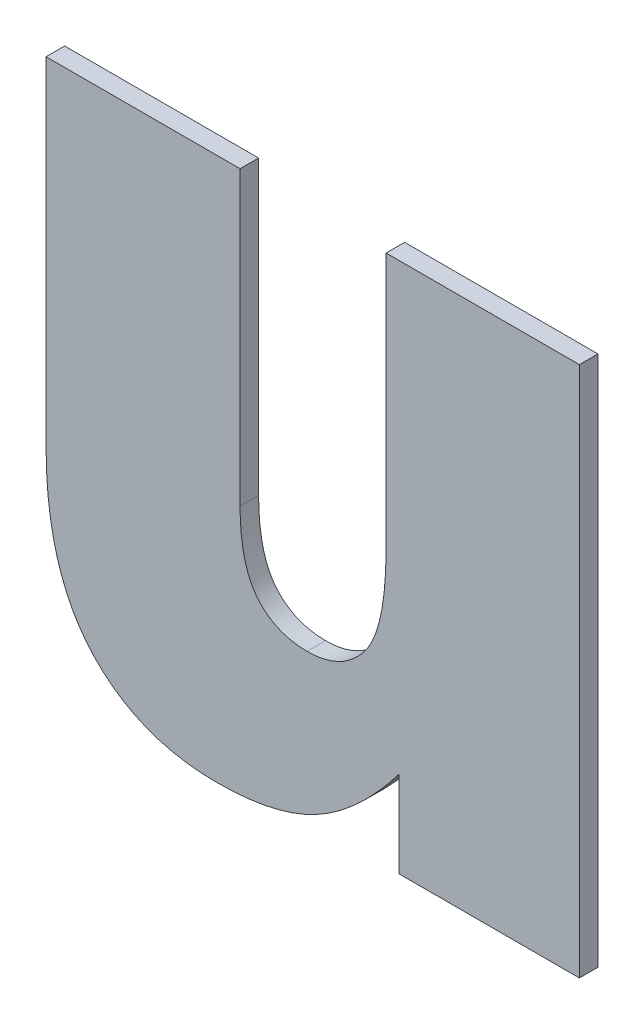
ISO-10303-21;
HEADER;
FILE_DESCRIPTION(('STEP AP214'),'2;1');
FILE_NAME('part.step','',(''),(''),'','','');
FILE_SCHEMA(('AUTOMOTIVE_DESIGN { 1 0 10303 214 1 1 1 1 }'));
ENDSEC;
DATA;
#1=APPLICATION_CONTEXT('core data for automotive mechanical design processes');
#2=APPLICATION_PROTOCOL_DEFINITION('international standard','automotive_design',2000,#1);
#3=PRODUCT_CONTEXT('',#1,'mechanical');
#4=PRODUCT('Part','Part','',(#3));
#5=PRODUCT_RELATED_PRODUCT_CATEGORY('part','',(#4));
#6=PRODUCT_DEFINITION_FORMATION('','',#4);
#7=PRODUCT_DEFINITION_CONTEXT('part definition',#1,'design');
#8=PRODUCT_DEFINITION('design','',#6,#7);
#9=PRODUCT_DEFINITION_SHAPE('','',#8);
#10=(LENGTH_UNIT() NAMED_UNIT(*) SI_UNIT(.MILLI.,.METRE.));
#11=(NAMED_UNIT(*) PLANE_ANGLE_UNIT() SI_UNIT($,.RADIAN.));
#12=(NAMED_UNIT(*) SI_UNIT($,.STERADIAN.) SOLID_ANGLE_UNIT());
#13=UNCERTAINTY_MEASURE_WITH_UNIT(LENGTH_MEASURE(1.E-05),#10,'distance_accuracy_value','');
#14=(GEOMETRIC_REPRESENTATION_CONTEXT(3) GLOBAL_UNCERTAINTY_ASSIGNED_CONTEXT((#13)) GLOBAL_UNIT_ASSIGNED_CONTEXT((#10,
#11,#12)) REPRESENTATION_CONTEXT('',''));
#15=CARTESIAN_POINT('',(0.,0.,0.));
#16=DIRECTION('',(0.,0.,1.));
#17=DIRECTION('',(1.,0.,0.));
#18=AXIS2_PLACEMENT_3D('',#15,#16,#17);
#19=CARTESIAN_POINT('',(1.1338047431866,-0.683885085588771,0.));
#20=DIRECTION('',(1.,0.,0.));
#21=DIRECTION('',(0.,1.,0.));
#22=AXIS2_PLACEMENT_3D('',#19,#20,#21);
#23=PLANE('',#22);
#24=DIRECTION('',(0.,1.,0.));
#25=VECTOR('',#24,1.);
#26=CARTESIAN_POINT('',(1.1338047431866,-0.683885085588771,0.));
#27=LINE('',#26,#25);
#28=CARTESIAN_POINT('',(1.1338047431866,-0.683885085588771,0.));
#29=VERTEX_POINT('',#28);
#30=CARTESIAN_POINT('',(1.1338047431866,-0.636643661734989,0.));
#31=VERTEX_POINT('',#30);
#32=EDGE_CURVE('E11',#29,#31,#27,.T.);
#33=ORIENTED_EDGE('',*,*,#32,.T.);
#34=DIRECTION('',(0.,0.,1.));
#35=VECTOR('',#34,1.);
#36=CARTESIAN_POINT('',(1.1338047431866,-0.636643661734989,0.));
#37=LINE('',#36,#35);
#38=CARTESIAN_POINT('',(1.1338047431866,-0.636643661734989,0.003));
#39=VERTEX_POINT('',#38);
#40=EDGE_CURVE('E24',#31,#39,#37,.T.);
#41=ORIENTED_EDGE('',*,*,#40,.T.);
#42=DIRECTION('',(0.,1.,0.));
#43=VECTOR('',#42,1.);
#44=CARTESIAN_POINT('',(1.1338047431866,-0.683885085588771,0.003));
#45=LINE('',#44,#43);
#46=CARTESIAN_POINT('',(1.1338047431866,-0.683885085588771,0.003));
#47=VERTEX_POINT('',#46);
#48=EDGE_CURVE('E124',#47,#39,#45,.T.);
#49=ORIENTED_EDGE('',*,*,#48,.F.);
#50=DIRECTION('',(0.,0.,1.));
#51=VECTOR('',#50,1.);
#52=CARTESIAN_POINT('',(1.1338047431866,-0.683885085588771,0.));
#53=LINE('',#52,#51);
#54=EDGE_CURVE('E243',#29,#47,#53,.T.);
#55=ORIENTED_EDGE('',*,*,#54,.F.);
#56=EDGE_LOOP('',(#33,#41,#49,#55));
#57=FACE_BOUND('',#56,.T.);
#58=ADVANCED_FACE('F17',(#57),#23,.T.);
#59=CARTESIAN_POINT('',(1.1446451665347,-0.698833458837191,0.));
#60=CARTESIAN_POINT('',(1.1446451665347,-0.698833458837191,0.003));
#61=CARTESIAN_POINT('',(1.1395102291592,-0.69883346021446,0.));
#62=CARTESIAN_POINT('',(1.1395102291592,-0.69883346021446,0.003));
#63=CARTESIAN_POINT('',(1.1338047413503,-0.691986878577577,0.));
#64=CARTESIAN_POINT('',(1.1338047413503,-0.691986878577577,0.003));
#65=CARTESIAN_POINT('',(1.1338047431866,-0.683885085588771,0.));
#66=CARTESIAN_POINT('',(1.1338047431866,-0.683885085588771,0.003));
#67=B_SPLINE_SURFACE_WITH_KNOTS('',2,1,((#59,#60),(#61,#62),(#63,#64),(#65,#66)),.UNSPECIFIED.,
.F.,.F.,.F.,(3,1,3),(2,2),(-2.,-1.,0.),(0.,0.0003),.UNSPECIFIED.);
#68=CARTESIAN_POINT('',(1.1446451665347,-0.698833458837191,0.));
#69=CARTESIAN_POINT('',(1.1395102291592,-0.69883346021446,0.));
#70=CARTESIAN_POINT('',(1.1338047413503,-0.691986878577577,0.));
#71=CARTESIAN_POINT('',(1.1338047431866,-0.683885085588771,0.));
#72=B_SPLINE_CURVE_WITH_KNOTS('',2,(#68,#69,#70,#71),.UNSPECIFIED.,.F.,.F.,(3,1,3),(-2.,-1.,0.),.UNSPECIFIED.);
#73=CARTESIAN_POINT('',(1.1446451665347,-0.698833458837191,0.));
#74=VERTEX_POINT('',#73);
#75=EDGE_CURVE('E235',#74,#29,#72,.T.);
#76=CARTESIAN_POINT('',(1.1446451665347,-0.698833458837191,0.003));
#77=CARTESIAN_POINT('',(1.1395102291592,-0.69883346021446,0.003));
#78=CARTESIAN_POINT('',(1.1338047413503,-0.691986878577577,0.003));
#79=CARTESIAN_POINT('',(1.1338047431866,-0.683885085588771,0.003));
#80=B_SPLINE_CURVE_WITH_KNOTS('',2,(#76,#77,#78,#79),.UNSPECIFIED.,.F.,.F.,(3,1,3),(-2.,-1.,0.),.UNSPECIFIED.);
#81=CARTESIAN_POINT('',(1.1446451665347,-0.698833458837191,0.003));
#82=VERTEX_POINT('',#81);
#83=EDGE_CURVE('E231',#82,#47,#80,.T.);
#84=DIRECTION('',(0.,0.,1.));
#85=VECTOR('',#84,1.);
#86=CARTESIAN_POINT('',(1.1446451665347,-0.698833458837191,0.));
#87=LINE('',#86,#85);
#88=EDGE_CURVE('E225',#74,#82,#87,.T.);
#89=ORIENTED_EDGE('',*,*,#75,.T.);
#90=ORIENTED_EDGE('',*,*,#54,.T.);
#91=ORIENTED_EDGE('',*,*,#83,.F.);
#92=ORIENTED_EDGE('',*,*,#88,.F.);
#93=EDGE_LOOP('',(#89,#90,#91,#92));
#94=FACE_BOUND('',#93,.T.);
#95=ADVANCED_FACE('F275',(#94),#67,.T.);
#96=CARTESIAN_POINT('',(1.1574254551135,-0.678065489896639,0.));
#97=CARTESIAN_POINT('',(1.1574254551135,-0.678065489896639,0.003));
#98=CARTESIAN_POINT('',(1.1574255414474,-0.689818791000043,0.));
#99=CARTESIAN_POINT('',(1.1574255414474,-0.689818791000043,0.003));
#100=CARTESIAN_POINT('',(1.1502366953393,-0.698833511642771,0.));
#101=CARTESIAN_POINT('',(1.1502366953393,-0.698833511642771,0.003));
#102=CARTESIAN_POINT('',(1.1446451665347,-0.698833458837191,0.));
#103=CARTESIAN_POINT('',(1.1446451665347,-0.698833458837191,0.003));
#104=B_SPLINE_SURFACE_WITH_KNOTS('',2,1,((#96,#97),(#98,#99),(#100,#101),(#102,#103)),
.UNSPECIFIED.,.F.,.F.,.F.,(3,1,3),(2,2),(-2.,-1.,0.),(0.,0.0003),.UNSPECIFIED.);
#105=CARTESIAN_POINT('',(1.1574254551135,-0.678065489896639,0.));
#106=CARTESIAN_POINT('',(1.1574255414474,-0.689818791000043,0.));
#107=CARTESIAN_POINT('',(1.1502366953393,-0.698833511642771,0.));
#108=CARTESIAN_POINT('',(1.1446451665347,-0.698833458837191,0.));
#109=B_SPLINE_CURVE_WITH_KNOTS('',2,(#105,#106,#107,#108),.UNSPECIFIED.,.F.,.F.,(3,1,3),(-2.,
-1.,0.),.UNSPECIFIED.);
#110=CARTESIAN_POINT('',(1.1574254551135,-0.678065489896639,0.));
#111=VERTEX_POINT('',#110);
#112=EDGE_CURVE('E217',#111,#74,#109,.T.);
#113=CARTESIAN_POINT('',(1.1574254551135,-0.678065489896639,0.003));
#114=CARTESIAN_POINT('',(1.1574255414474,-0.689818791000043,0.003));
#115=CARTESIAN_POINT('',(1.1502366953393,-0.698833511642771,0.003));
#116=CARTESIAN_POINT('',(1.1446451665347,-0.698833458837191,0.003));
#117=B_SPLINE_CURVE_WITH_KNOTS('',2,(#113,#114,#115,#116),.UNSPECIFIED.,.F.,.F.,(3,1,3),(-2.,
-1.,0.),.UNSPECIFIED.);
#118=CARTESIAN_POINT('',(1.1574254551135,-0.678065489896639,0.003));
#119=VERTEX_POINT('',#118);
#120=EDGE_CURVE('E212',#119,#82,#117,.T.);
#121=DIRECTION('',(0.,0.,1.));
#122=VECTOR('',#121,1.);
#123=CARTESIAN_POINT('',(1.1574254551135,-0.678065489896639,0.));
#124=LINE('',#123,#122);
#125=EDGE_CURVE('E209',#111,#119,#124,.T.);
#126=ORIENTED_EDGE('',*,*,#112,.T.);
#127=ORIENTED_EDGE('',*,*,#88,.T.);
#128=ORIENTED_EDGE('',*,*,#120,.F.);
#129=ORIENTED_EDGE('',*,*,#125,.F.);
#130=EDGE_LOOP('',(#126,#127,#128,#129));
#131=FACE_BOUND('',#130,.T.);
#132=ADVANCED_FACE('F272',(#131),#104,.T.);
#133=CARTESIAN_POINT('',(1.1574254551135,-0.636643661734989,0.));
#134=DIRECTION('',(-1.,0.,0.));
#135=DIRECTION('',(0.,-1.,0.));
#136=AXIS2_PLACEMENT_3D('',#133,#134,#135);
#137=PLANE('',#136);
#138=DIRECTION('',(0.,-1.,0.));
#139=VECTOR('',#138,1.);
#140=CARTESIAN_POINT('',(1.1574254551135,-0.636643661734989,0.));
#141=LINE('',#140,#139);
#142=CARTESIAN_POINT('',(1.1574254551135,-0.636643661734989,0.));
#143=VERTEX_POINT('',#142);
#144=EDGE_CURVE('E206',#143,#111,#141,.T.);
#145=ORIENTED_EDGE('',*,*,#144,.T.);
#146=ORIENTED_EDGE('',*,*,#125,.T.);
#147=DIRECTION('',(0.,-1.,0.));
#148=VECTOR('',#147,1.);
#149=CARTESIAN_POINT('',(1.1574254551135,-0.636643661734989,0.003));
#150=LINE('',#149,#148);
#151=CARTESIAN_POINT('',(1.1574254551135,-0.636643661734989,0.003));
#152=VERTEX_POINT('',#151);
#153=EDGE_CURVE('E203',#152,#119,#150,.T.);
#154=ORIENTED_EDGE('',*,*,#153,.F.);
#155=DIRECTION('',(0.,0.,1.));
#156=VECTOR('',#155,1.);
#157=CARTESIAN_POINT('',(1.1574254551135,-0.636643661734989,0.));
#158=LINE('',#157,#156);
#159=EDGE_CURVE('E200',#143,#152,#158,.T.);
#160=ORIENTED_EDGE('',*,*,#159,.F.);
#161=EDGE_LOOP('',(#145,#146,#154,#160));
#162=FACE_BOUND('',#161,.T.);
#163=ADVANCED_FACE('F269',(#162),#137,.T.);
#164=CARTESIAN_POINT('',(1.1886915182438,-0.636643661734989,0.));
#165=DIRECTION('',(0.,1.,0.));
#166=DIRECTION('',(-1.,0.,0.));
#167=AXIS2_PLACEMENT_3D('',#164,#165,#166);
#168=PLANE('',#167);
#169=DIRECTION('',(-1.,0.,0.));
#170=VECTOR('',#169,1.);
#171=CARTESIAN_POINT('',(1.1886915182438,-0.636643661734989,0.));
#172=LINE('',#171,#170);
#173=CARTESIAN_POINT('',(1.1886915182438,-0.636643661734989,0.));
#174=VERTEX_POINT('',#173);
#175=EDGE_CURVE('E197',#174,#143,#172,.T.);
#176=ORIENTED_EDGE('',*,*,#175,.T.);
#177=ORIENTED_EDGE('',*,*,#159,.T.);
#178=DIRECTION('',(-1.,0.,0.));
#179=VECTOR('',#178,1.);
#180=CARTESIAN_POINT('',(1.1886915182438,-0.636643661734989,0.003));
#181=LINE('',#180,#179);
#182=CARTESIAN_POINT('',(1.1886915182438,-0.636643661734989,0.003));
#183=VERTEX_POINT('',#182);
#184=EDGE_CURVE('E194',#183,#152,#181,.T.);
#185=ORIENTED_EDGE('',*,*,#184,.F.);
#186=DIRECTION('',(0.,0.,1.));
#187=VECTOR('',#186,1.);
#188=CARTESIAN_POINT('',(1.1886915182438,-0.636643661734989,0.));
#189=LINE('',#188,#187);
#190=EDGE_CURVE('E191',#174,#183,#189,.T.);
#191=ORIENTED_EDGE('',*,*,#190,.F.);
#192=EDGE_LOOP('',(#176,#177,#185,#191));
#193=FACE_BOUND('',#192,.T.);
#194=ADVANCED_FACE('F266',(#193),#168,.T.);
#195=CARTESIAN_POINT('',(1.1886915182438,-0.722568280483534,0.));
#196=DIRECTION('',(1.,0.,0.));
#197=DIRECTION('',(0.,1.,0.));
#198=AXIS2_PLACEMENT_3D('',#195,#196,#197);
#199=PLANE('',#198);
#200=DIRECTION('',(0.,1.,0.));
#201=VECTOR('',#200,1.);
#202=CARTESIAN_POINT('',(1.1886915182438,-0.722568280483534,0.));
#203=LINE('',#202,#201);
#204=CARTESIAN_POINT('',(1.1886915182438,-0.722568280483534,0.));
#205=VERTEX_POINT('',#204);
#206=EDGE_CURVE('E188',#205,#174,#203,.T.);
#207=ORIENTED_EDGE('',*,*,#206,.T.);
#208=ORIENTED_EDGE('',*,*,#190,.T.);
#209=DIRECTION('',(0.,1.,0.));
#210=VECTOR('',#209,1.);
#211=CARTESIAN_POINT('',(1.1886915182438,-0.722568280483534,0.003));
#212=LINE('',#211,#210);
#213=CARTESIAN_POINT('',(1.1886915182438,-0.722568280483534,0.003));
#214=VERTEX_POINT('',#213);
#215=EDGE_CURVE('E185',#214,#183,#212,.T.);
#216=ORIENTED_EDGE('',*,*,#215,.F.);
#217=DIRECTION('',(0.,0.,1.));
#218=VECTOR('',#217,1.);
#219=CARTESIAN_POINT('',(1.1886915182438,-0.722568280483534,0.));
#220=LINE('',#219,#218);
#221=EDGE_CURVE('E182',#205,#214,#220,.T.);
#222=ORIENTED_EDGE('',*,*,#221,.F.);
#223=EDGE_LOOP('',(#207,#208,#216,#222));
#224=FACE_BOUND('',#223,.T.);
#225=ADVANCED_FACE('F263',(#224),#199,.T.);
#226=CARTESIAN_POINT('',(1.1594794300636,-0.722568280483534,0.));
#227=DIRECTION('',(0.,-1.,0.));
#228=DIRECTION('',(1.,0.,0.));
#229=AXIS2_PLACEMENT_3D('',#226,#227,#228);
#230=PLANE('',#229);
#231=DIRECTION('',(1.,0.,0.));
#232=VECTOR('',#231,1.);
#233=CARTESIAN_POINT('',(1.1594794300636,-0.722568280483534,0.));
#234=LINE('',#233,#232);
#235=CARTESIAN_POINT('',(1.1594794300636,-0.722568280483534,0.));
#236=VERTEX_POINT('',#235);
#237=EDGE_CURVE('E179',#236,#205,#234,.T.);
#238=ORIENTED_EDGE('',*,*,#237,.T.);
#239=ORIENTED_EDGE('',*,*,#221,.T.);
#240=DIRECTION('',(1.,0.,0.));
#241=VECTOR('',#240,1.);
#242=CARTESIAN_POINT('',(1.1594794300636,-0.722568280483534,0.003));
#243=LINE('',#242,#241);
#244=CARTESIAN_POINT('',(1.1594794300636,-0.722568280483534,0.003));
#245=VERTEX_POINT('',#244);
#246=EDGE_CURVE('E176',#245,#214,#243,.T.);
#247=ORIENTED_EDGE('',*,*,#246,.F.);
#248=DIRECTION('',(0.,0.,1.));
#249=VECTOR('',#248,1.);
#250=CARTESIAN_POINT('',(1.1594794300636,-0.722568280483534,0.));
#251=LINE('',#250,#249);
#252=EDGE_CURVE('E173',#236,#245,#251,.T.);
#253=ORIENTED_EDGE('',*,*,#252,.F.);
#254=EDGE_LOOP('',(#238,#239,#247,#253));
#255=FACE_BOUND('',#254,.T.);
#256=ADVANCED_FACE('F260',(#255),#230,.T.);
#257=CARTESIAN_POINT('',(1.1594794300636,-0.708646894710198,0.));
#258=DIRECTION('',(-1.,0.,0.));
#259=DIRECTION('',(0.,-1.,0.));
#260=AXIS2_PLACEMENT_3D('',#257,#258,#259);
#261=PLANE('',#260);
#262=DIRECTION('',(0.,-1.,0.));
#263=VECTOR('',#262,1.);
#264=CARTESIAN_POINT('',(1.1594794300636,-0.708646894710198,0.));
#265=LINE('',#264,#263);
#266=CARTESIAN_POINT('',(1.1594794300636,-0.708646894710198,0.));
#267=VERTEX_POINT('',#266);
#268=EDGE_CURVE('E170',#267,#236,#265,.T.);
#269=ORIENTED_EDGE('',*,*,#268,.T.);
#270=ORIENTED_EDGE('',*,*,#252,.T.);
#271=DIRECTION('',(0.,-1.,0.));
#272=VECTOR('',#271,1.);
#273=CARTESIAN_POINT('',(1.1594794300636,-0.708646894710198,0.003));
#274=LINE('',#273,#272);
#275=CARTESIAN_POINT('',(1.1594794300636,-0.708646894710198,0.003));
#276=VERTEX_POINT('',#275);
#277=EDGE_CURVE('E167',#276,#245,#274,.T.);
#278=ORIENTED_EDGE('',*,*,#277,.F.);
#279=DIRECTION('',(0.,0.,1.));
#280=VECTOR('',#279,1.);
#281=CARTESIAN_POINT('',(1.1594794300636,-0.708646894710198,0.));
#282=LINE('',#281,#280);
#283=EDGE_CURVE('E161',#267,#276,#282,.T.);
#284=ORIENTED_EDGE('',*,*,#283,.F.);
#285=EDGE_LOOP('',(#269,#270,#278,#284));
#286=FACE_BOUND('',#285,.T.);
#287=ADVANCED_FACE('F257',(#286),#261,.T.);
#288=CARTESIAN_POINT('',(1.1300391224446,-0.724508145714247,0.));
#289=CARTESIAN_POINT('',(1.1300391224446,-0.724508145714247,0.003));
#290=CARTESIAN_POINT('',(1.1396243388787,-0.724508098846114,0.));
#291=CARTESIAN_POINT('',(1.1396243388787,-0.724508098846114,0.003));
#292=CARTESIAN_POINT('',(1.1529751403455,-0.717205011520606,0.));
#293=CARTESIAN_POINT('',(1.1529751403455,-0.717205011520606,0.003));
#294=CARTESIAN_POINT('',(1.1594794300636,-0.708646894710198,0.));
#295=CARTESIAN_POINT('',(1.1594794300636,-0.708646894710198,0.003));
#296=B_SPLINE_SURFACE_WITH_KNOTS('',2,1,((#288,#289),(#290,#291),(#292,#293),(#294,#295)),
.UNSPECIFIED.,.F.,.F.,.F.,(3,1,3),(2,2),(-2.,-1.,0.),(0.,0.0003),.UNSPECIFIED.);
#297=CARTESIAN_POINT('',(1.1300391224446,-0.724508145714247,0.));
#298=CARTESIAN_POINT('',(1.1396243388787,-0.724508098846114,0.));
#299=CARTESIAN_POINT('',(1.1529751403455,-0.717205011520606,0.));
#300=CARTESIAN_POINT('',(1.1594794300636,-0.708646894710198,0.));
#301=B_SPLINE_CURVE_WITH_KNOTS('',2,(#297,#298,#299,#300),.UNSPECIFIED.,.F.,.F.,(3,1,3),(-2.,
-1.,0.),.UNSPECIFIED.);
#302=CARTESIAN_POINT('',(1.1300391224446,-0.724508145714247,0.));
#303=VERTEX_POINT('',#302);
#304=EDGE_CURVE('E153',#303,#267,#301,.T.);
#305=CARTESIAN_POINT('',(1.1300391224446,-0.724508145714247,0.003));
#306=CARTESIAN_POINT('',(1.1396243388787,-0.724508098846114,0.003));
#307=CARTESIAN_POINT('',(1.1529751403455,-0.717205011520606,0.003));
#308=CARTESIAN_POINT('',(1.1594794300636,-0.708646894710198,0.003));
#309=B_SPLINE_CURVE_WITH_KNOTS('',2,(#305,#306,#307,#308),.UNSPECIFIED.,.F.,.F.,(3,1,3),(-2.,
-1.,0.),.UNSPECIFIED.);
#310=CARTESIAN_POINT('',(1.1300391224446,-0.724508145714247,0.003));
#311=VERTEX_POINT('',#310);
#312=EDGE_CURVE('E148',#311,#276,#309,.T.);
#313=DIRECTION('',(0.,0.,1.));
#314=VECTOR('',#313,1.);
#315=CARTESIAN_POINT('',(1.1300391224446,-0.724508145714247,0.));
#316=LINE('',#315,#314);
#317=EDGE_CURVE('E142',#303,#311,#316,.T.);
#318=ORIENTED_EDGE('',*,*,#304,.T.);
#319=ORIENTED_EDGE('',*,*,#283,.T.);
#320=ORIENTED_EDGE('',*,*,#312,.F.);
#321=ORIENTED_EDGE('',*,*,#317,.F.);
#322=EDGE_LOOP('',(#318,#319,#320,#321));
#323=FACE_BOUND('',#322,.T.);
#324=ADVANCED_FACE('F254',(#323),#296,.T.);
#325=CARTESIAN_POINT('',(1.1024245703368,-0.691302217353257,0.));
#326=CARTESIAN_POINT('',(1.1024245703368,-0.691302217353257,0.003));
#327=CARTESIAN_POINT('',(1.1024245995288,-0.708190455832373,0.));
#328=CARTESIAN_POINT('',(1.1024245995288,-0.708190455832373,0.003));
#329=CARTESIAN_POINT('',(1.1171447815439,-0.72450812026988,0.));
#330=CARTESIAN_POINT('',(1.1171447815439,-0.72450812026988,0.003));
#331=CARTESIAN_POINT('',(1.1300391224446,-0.724508145714247,0.));
#332=CARTESIAN_POINT('',(1.1300391224446,-0.724508145714247,0.003));
#333=B_SPLINE_SURFACE_WITH_KNOTS('',2,1,((#325,#326),(#327,#328),(#329,#330),(#331,#332)),
.UNSPECIFIED.,.F.,.F.,.F.,(3,1,3),(2,2),(-2.,-1.,0.),(0.,0.0003),.UNSPECIFIED.);
#334=CARTESIAN_POINT('',(1.1024245703368,-0.691302217353257,0.));
#335=CARTESIAN_POINT('',(1.1024245995288,-0.708190455832373,0.));
#336=CARTESIAN_POINT('',(1.1171447815439,-0.72450812026988,0.));
#337=CARTESIAN_POINT('',(1.1300391224446,-0.724508145714247,0.));
#338=B_SPLINE_CURVE_WITH_KNOTS('',2,(#334,#335,#336,#337),.UNSPECIFIED.,.F.,.F.,(3,1,3),(-2.,
-1.,0.),.UNSPECIFIED.);
#339=CARTESIAN_POINT('',(1.1024245703368,-0.691302217353257,0.));
#340=VERTEX_POINT('',#339);
#341=EDGE_CURVE('E134',#340,#303,#338,.T.);
#342=CARTESIAN_POINT('',(1.1024245703368,-0.691302217353257,0.003));
#343=CARTESIAN_POINT('',(1.1024245995288,-0.708190455832373,0.003));
#344=CARTESIAN_POINT('',(1.1171447815439,-0.72450812026988,0.003));
#345=CARTESIAN_POINT('',(1.1300391224446,-0.724508145714247,0.003));
#346=B_SPLINE_CURVE_WITH_KNOTS('',2,(#342,#343,#344,#345),.UNSPECIFIED.,.F.,.F.,(3,1,3),(-2.,
-1.,0.),.UNSPECIFIED.);
#347=CARTESIAN_POINT('',(1.1024245703368,-0.691302217353257,0.003));
#348=VERTEX_POINT('',#347);
#349=EDGE_CURVE('E130',#348,#311,#346,.T.);
#350=DIRECTION('',(0.,0.,1.));
#351=VECTOR('',#350,1.);
#352=CARTESIAN_POINT('',(1.1024245703368,-0.691302217353257,0.));
#353=LINE('',#352,#351);
#354=EDGE_CURVE('E109',#340,#348,#353,.T.);
#355=ORIENTED_EDGE('',*,*,#341,.T.);
#356=ORIENTED_EDGE('',*,*,#317,.T.);
#357=ORIENTED_EDGE('',*,*,#349,.F.);
#358=ORIENTED_EDGE('',*,*,#354,.F.);
#359=EDGE_LOOP('',(#355,#356,#357,#358));
#360=FACE_BOUND('',#359,.T.);
#361=ADVANCED_FACE('F252',(#360),#333,.T.);
#362=CARTESIAN_POINT('',(1.1024245703368,-0.636643661734989,0.));
#363=DIRECTION('',(-1.,0.,0.));
#364=DIRECTION('',(0.,-1.,0.));
#365=AXIS2_PLACEMENT_3D('',#362,#363,#364);
#366=PLANE('',#365);
#367=DIRECTION('',(0.,-1.,0.));
#368=VECTOR('',#367,1.);
#369=CARTESIAN_POINT('',(1.1024245703368,-0.636643661734989,0.));
#370=LINE('',#369,#368);
#371=CARTESIAN_POINT('',(1.1024245703368,-0.636643661734989,0.));
#372=VERTEX_POINT('',#371);
#373=EDGE_CURVE('E113',#372,#340,#370,.T.);
#374=ORIENTED_EDGE('',*,*,#373,.T.);
#375=ORIENTED_EDGE('',*,*,#354,.T.);
#376=DIRECTION('',(0.,-1.,0.));
#377=VECTOR('',#376,1.);
#378=CARTESIAN_POINT('',(1.1024245703368,-0.636643661734989,0.003));
#379=LINE('',#378,#377);
#380=CARTESIAN_POINT('',(1.1024245703368,-0.636643661734989,0.003));
#381=VERTEX_POINT('',#380);
#382=EDGE_CURVE('E102',#381,#348,#379,.T.);
#383=ORIENTED_EDGE('',*,*,#382,.F.);
#384=DIRECTION('',(0.,0.,1.));
#385=VECTOR('',#384,1.);
#386=CARTESIAN_POINT('',(1.1024245703368,-0.636643661734989,0.));
#387=LINE('',#386,#385);
#388=EDGE_CURVE('E106',#372,#381,#387,.T.);
#389=ORIENTED_EDGE('',*,*,#388,.F.);
#390=EDGE_LOOP('',(#374,#375,#383,#389));
#391=FACE_BOUND('',#390,.T.);
#392=ADVANCED_FACE('F105',(#391),#366,.T.);
#393=CARTESIAN_POINT('',(1.1338047431866,-0.636643661734989,0.));
#394=DIRECTION('',(0.,1.,0.));
#395=DIRECTION('',(-1.,0.,0.));
#396=AXIS2_PLACEMENT_3D('',#393,#394,#395);
#397=PLANE('',#396);
#398=DIRECTION('',(-1.,0.,0.));
#399=VECTOR('',#398,1.);
#400=CARTESIAN_POINT('',(1.1338047431866,-0.636643661734989,0.));
#401=LINE('',#400,#399);
#402=EDGE_CURVE('E119',#31,#372,#401,.T.);
#403=ORIENTED_EDGE('',*,*,#402,.T.);
#404=ORIENTED_EDGE('',*,*,#388,.T.);
#405=DIRECTION('',(-1.,0.,0.));
#406=VECTOR('',#405,1.);
#407=CARTESIAN_POINT('',(1.1338047431866,-0.636643661734989,0.003));
#408=LINE('',#407,#406);
#409=EDGE_CURVE('E118',#39,#381,#408,.T.);
#410=ORIENTED_EDGE('',*,*,#409,.F.);
#411=ORIENTED_EDGE('',*,*,#40,.F.);
#412=EDGE_LOOP('',(#403,#404,#410,#411));
#413=FACE_BOUND('',#412,.T.);
#414=ADVANCED_FACE('F117',(#413),#397,.T.);
#415=CARTESIAN_POINT('',(1.1455580442903,-0.680575903724618,0.003));
#416=DIRECTION('',(0.,0.,1.));
#417=DIRECTION('',(1.,0.,0.));
#418=AXIS2_PLACEMENT_3D('',#415,#416,#417);
#419=PLANE('',#418);
#420=ORIENTED_EDGE('',*,*,#409,.T.);
#421=ORIENTED_EDGE('',*,*,#382,.T.);
#422=ORIENTED_EDGE('',*,*,#349,.T.);
#423=ORIENTED_EDGE('',*,*,#312,.T.);
#424=ORIENTED_EDGE('',*,*,#277,.T.);
#425=ORIENTED_EDGE('',*,*,#246,.T.);
#426=ORIENTED_EDGE('',*,*,#215,.T.);
#427=ORIENTED_EDGE('',*,*,#184,.T.);
#428=ORIENTED_EDGE('',*,*,#153,.T.);
#429=ORIENTED_EDGE('',*,*,#120,.T.);
#430=ORIENTED_EDGE('',*,*,#83,.T.);
#431=ORIENTED_EDGE('',*,*,#48,.T.);
#432=EDGE_LOOP('',(#420,#421,#422,#423,#424,#425,#426,#427,#428,#429,#430,#431));
#433=FACE_BOUND('',#432,.T.);
#434=ADVANCED_FACE('F122',(#433),#419,.T.);
#435=CARTESIAN_POINT('',(1.1455580442903,-0.680575903724618,0.));
#436=DIRECTION('',(0.,0.,1.));
#437=DIRECTION('',(1.,0.,0.));
#438=AXIS2_PLACEMENT_3D('',#435,#436,#437);
#439=PLANE('',#438);
#440=ORIENTED_EDGE('',*,*,#402,.F.);
#441=ORIENTED_EDGE('',*,*,#32,.F.);
#442=ORIENTED_EDGE('',*,*,#75,.F.);
#443=ORIENTED_EDGE('',*,*,#112,.F.);
#444=ORIENTED_EDGE('',*,*,#144,.F.);
#445=ORIENTED_EDGE('',*,*,#175,.F.);
#446=ORIENTED_EDGE('',*,*,#206,.F.);
#447=ORIENTED_EDGE('',*,*,#237,.F.);
#448=ORIENTED_EDGE('',*,*,#268,.F.);
#449=ORIENTED_EDGE('',*,*,#304,.F.);
#450=ORIENTED_EDGE('',*,*,#341,.F.);
#451=ORIENTED_EDGE('',*,*,#373,.F.);
#452=EDGE_LOOP('',(#440,#441,#442,#443,#444,#445,#446,#447,#448,#449,#450,#451));
#453=FACE_BOUND('',#452,.T.);
#454=ADVANCED_FACE('F249',(#453),#439,.F.);
#455=CLOSED_SHELL('',(#58,#95,#132,#163,#194,#225,#256,#287,#324,#361,#392,#414,#434,#454));
#456=MANIFOLD_SOLID_BREP('B1',#455);
#457=ADVANCED_BREP_SHAPE_REPRESENTATION('',(#18,#456),#14);
#458=SHAPE_DEFINITION_REPRESENTATION(#9,#457);
ENDSEC;
END-ISO-10303-21;
